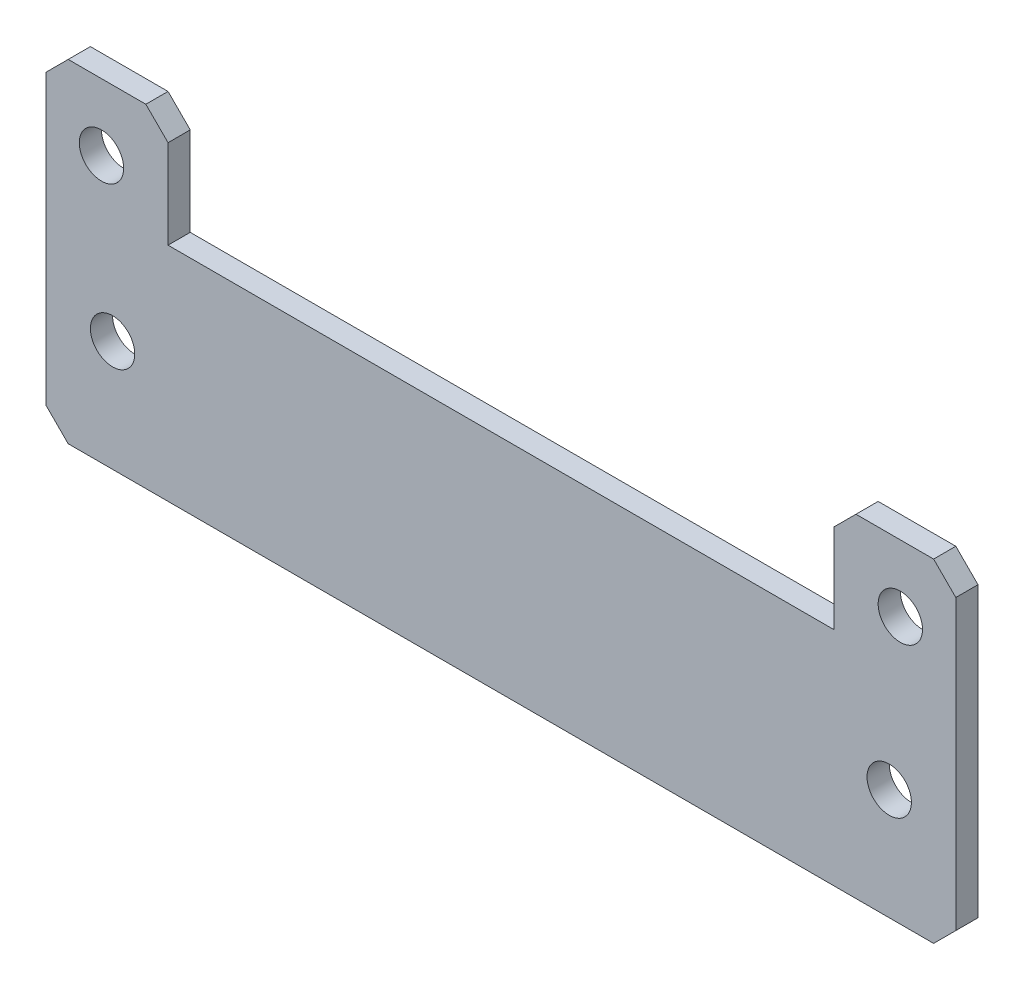
ISO-10303-21;
HEADER;
FILE_DESCRIPTION(('STEP AP214'),'2;1');
FILE_NAME('part.step','',(''),(''),'','','');
FILE_SCHEMA(('AUTOMOTIVE_DESIGN { 1 0 10303 214 1 1 1 1 }'));
ENDSEC;
DATA;
#1=APPLICATION_CONTEXT('core data for automotive mechanical design processes');
#2=APPLICATION_PROTOCOL_DEFINITION('international standard','automotive_design',2000,#1);
#3=PRODUCT_CONTEXT('',#1,'mechanical');
#4=PRODUCT('Part','Part','',(#3));
#5=PRODUCT_RELATED_PRODUCT_CATEGORY('part','',(#4));
#6=PRODUCT_DEFINITION_FORMATION('','',#4);
#7=PRODUCT_DEFINITION_CONTEXT('part definition',#1,'design');
#8=PRODUCT_DEFINITION('design','',#6,#7);
#9=PRODUCT_DEFINITION_SHAPE('','',#8);
#10=(LENGTH_UNIT() NAMED_UNIT(*) SI_UNIT(.MILLI.,.METRE.));
#11=(NAMED_UNIT(*) PLANE_ANGLE_UNIT() SI_UNIT($,.RADIAN.));
#12=(NAMED_UNIT(*) SI_UNIT($,.STERADIAN.) SOLID_ANGLE_UNIT());
#13=UNCERTAINTY_MEASURE_WITH_UNIT(LENGTH_MEASURE(1.E-05),#10,'distance_accuracy_value','');
#14=(GEOMETRIC_REPRESENTATION_CONTEXT(3) GLOBAL_UNCERTAINTY_ASSIGNED_CONTEXT((#13)) GLOBAL_UNIT_ASSIGNED_CONTEXT((#10,
#11,#12)) REPRESENTATION_CONTEXT('',''));
#15=CARTESIAN_POINT('',(0.,0.,0.));
#16=DIRECTION('',(0.,0.,1.));
#17=DIRECTION('',(1.,0.,0.));
#18=AXIS2_PLACEMENT_3D('',#15,#16,#17);
#19=CARTESIAN_POINT('',(-1.00000000000003,-1.00000000000003,2.));
#20=DIRECTION('',(0.707106781186548,0.707106781186547,0.));
#21=DIRECTION('',(-0.707106781186547,0.707106781186548,0.));
#22=AXIS2_PLACEMENT_3D('',#19,#20,#21);
#23=PLANE('',#22);
#24=DIRECTION('',(0.707106781186547,-0.707106781186548,0.));
#25=VECTOR('',#24,1.);
#26=CARTESIAN_POINT('',(-1.00000000000003,-1.00000000000003,0.));
#27=LINE('',#26,#25);
#28=CARTESIAN_POINT('',(-32.,30.,0.));
#29=VERTEX_POINT('',#28);
#30=CARTESIAN_POINT('',(-30.,28.,0.));
#31=VERTEX_POINT('',#30);
#32=EDGE_CURVE('E162',#29,#31,#27,.T.);
#33=ORIENTED_EDGE('',*,*,#32,.F.);
#34=DIRECTION('',(0.,0.,-1.));
#35=VECTOR('',#34,1.);
#36=CARTESIAN_POINT('',(-32.,30.,2.));
#37=LINE('',#36,#35);
#38=CARTESIAN_POINT('',(-32.,30.,2.));
#39=VERTEX_POINT('',#38);
#40=EDGE_CURVE('E11',#39,#29,#37,.T.);
#41=ORIENTED_EDGE('',*,*,#40,.F.);
#42=DIRECTION('',(0.707106781186547,-0.707106781186548,0.));
#43=VECTOR('',#42,1.);
#44=CARTESIAN_POINT('',(-1.00000000000003,-1.00000000000003,2.));
#45=LINE('',#44,#43);
#46=CARTESIAN_POINT('',(-30.,28.,2.));
#47=VERTEX_POINT('',#46);
#48=EDGE_CURVE('E195',#39,#47,#45,.T.);
#49=ORIENTED_EDGE('',*,*,#48,.T.);
#50=DIRECTION('',(0.,0.,-1.));
#51=VECTOR('',#50,1.);
#52=CARTESIAN_POINT('',(-30.,28.,2.));
#53=LINE('',#52,#51);
#54=EDGE_CURVE('E49',#47,#31,#53,.T.);
#55=ORIENTED_EDGE('',*,*,#54,.T.);
#56=EDGE_LOOP('',(#33,#41,#49,#55));
#57=FACE_BOUND('',#56,.T.);
#58=ADVANCED_FACE('F33',(#57),#23,.T.);
#59=CARTESIAN_POINT('',(0.,30.,2.));
#60=DIRECTION('',(0.,1.,0.));
#61=DIRECTION('',(0.,0.,1.));
#62=AXIS2_PLACEMENT_3D('',#59,#60,#61);
#63=PLANE('',#62);
#64=DIRECTION('',(1.,0.,0.));
#65=VECTOR('',#64,1.);
#66=CARTESIAN_POINT('',(0.,30.,0.));
#67=LINE('',#66,#65);
#68=CARTESIAN_POINT('',(-39.,30.,0.));
#69=VERTEX_POINT('',#68);
#70=EDGE_CURVE('E164',#69,#29,#67,.T.);
#71=ORIENTED_EDGE('',*,*,#70,.F.);
#72=DIRECTION('',(0.,0.,-1.));
#73=VECTOR('',#72,1.);
#74=CARTESIAN_POINT('',(-39.,30.,2.));
#75=LINE('',#74,#73);
#76=CARTESIAN_POINT('',(-39.,30.,2.));
#77=VERTEX_POINT('',#76);
#78=EDGE_CURVE('E41',#77,#69,#75,.T.);
#79=ORIENTED_EDGE('',*,*,#78,.F.);
#80=DIRECTION('',(1.,0.,0.));
#81=VECTOR('',#80,1.);
#82=CARTESIAN_POINT('',(0.,30.,2.));
#83=LINE('',#82,#81);
#84=EDGE_CURVE('E242',#77,#39,#83,.T.);
#85=ORIENTED_EDGE('',*,*,#84,.T.);
#86=ORIENTED_EDGE('',*,*,#40,.T.);
#87=EDGE_LOOP('',(#71,#79,#85,#86));
#88=FACE_BOUND('',#87,.T.);
#89=ADVANCED_FACE('F229',(#88),#63,.T.);
#90=CARTESIAN_POINT('',(-34.5,34.5,2.));
#91=DIRECTION('',(-0.707106781186547,0.707106781186547,0.));
#92=DIRECTION('',(-0.707106781186548,-0.707106781186548,0.));
#93=AXIS2_PLACEMENT_3D('',#90,#91,#92);
#94=PLANE('',#93);
#95=DIRECTION('',(0.707106781186548,0.707106781186548,0.));
#96=VECTOR('',#95,1.);
#97=CARTESIAN_POINT('',(-34.5,34.5,0.));
#98=LINE('',#97,#96);
#99=CARTESIAN_POINT('',(-41.,28.,0.));
#100=VERTEX_POINT('',#99);
#101=EDGE_CURVE('E168',#100,#69,#98,.T.);
#102=ORIENTED_EDGE('',*,*,#101,.F.);
#103=DIRECTION('',(0.,0.,-1.));
#104=VECTOR('',#103,1.);
#105=CARTESIAN_POINT('',(-41.,28.,2.));
#106=LINE('',#105,#104);
#107=CARTESIAN_POINT('',(-41.,28.,2.));
#108=VERTEX_POINT('',#107);
#109=EDGE_CURVE('E218',#108,#100,#106,.T.);
#110=ORIENTED_EDGE('',*,*,#109,.F.);
#111=DIRECTION('',(0.707106781186548,0.707106781186548,0.));
#112=VECTOR('',#111,1.);
#113=CARTESIAN_POINT('',(-34.5,34.5,2.));
#114=LINE('',#113,#112);
#115=EDGE_CURVE('E225',#108,#77,#114,.T.);
#116=ORIENTED_EDGE('',*,*,#115,.T.);
#117=ORIENTED_EDGE('',*,*,#78,.T.);
#118=EDGE_LOOP('',(#102,#110,#116,#117));
#119=FACE_BOUND('',#118,.T.);
#120=ADVANCED_FACE('F223',(#119),#94,.T.);
#121=CARTESIAN_POINT('',(-41.,0.,2.));
#122=DIRECTION('',(-1.,0.,0.));
#123=DIRECTION('',(0.,0.,1.));
#124=AXIS2_PLACEMENT_3D('',#121,#122,#123);
#125=PLANE('',#124);
#126=DIRECTION('',(0.,1.,0.));
#127=VECTOR('',#126,1.);
#128=CARTESIAN_POINT('',(-41.,0.,0.));
#129=LINE('',#128,#127);
#130=CARTESIAN_POINT('',(-41.,2.,0.));
#131=VERTEX_POINT('',#130);
#132=EDGE_CURVE('E171',#131,#100,#129,.T.);
#133=ORIENTED_EDGE('',*,*,#132,.F.);
#134=DIRECTION('',(0.,0.,-1.));
#135=VECTOR('',#134,1.);
#136=CARTESIAN_POINT('',(-41.,2.,2.));
#137=LINE('',#136,#135);
#138=CARTESIAN_POINT('',(-41.,2.,2.));
#139=VERTEX_POINT('',#138);
#140=EDGE_CURVE('E216',#139,#131,#137,.T.);
#141=ORIENTED_EDGE('',*,*,#140,.F.);
#142=DIRECTION('',(0.,1.,0.));
#143=VECTOR('',#142,1.);
#144=CARTESIAN_POINT('',(-41.,0.,2.));
#145=LINE('',#144,#143);
#146=EDGE_CURVE('E239',#139,#108,#145,.T.);
#147=ORIENTED_EDGE('',*,*,#146,.T.);
#148=ORIENTED_EDGE('',*,*,#109,.T.);
#149=EDGE_LOOP('',(#133,#141,#147,#148));
#150=FACE_BOUND('',#149,.T.);
#151=ADVANCED_FACE('F236',(#150),#125,.T.);
#152=CARTESIAN_POINT('',(-19.5,-19.5,2.));
#153=DIRECTION('',(-0.707106781186547,-0.707106781186548,0.));
#154=DIRECTION('',(0.707106781186548,-0.707106781186547,0.));
#155=AXIS2_PLACEMENT_3D('',#152,#153,#154);
#156=PLANE('',#155);
#157=DIRECTION('',(-0.707106781186548,0.707106781186547,0.));
#158=VECTOR('',#157,1.);
#159=CARTESIAN_POINT('',(-19.5,-19.5,0.));
#160=LINE('',#159,#158);
#161=CARTESIAN_POINT('',(-39.,0.,0.));
#162=VERTEX_POINT('',#161);
#163=EDGE_CURVE('E174',#162,#131,#160,.T.);
#164=ORIENTED_EDGE('',*,*,#163,.F.);
#165=DIRECTION('',(0.,0.,-1.));
#166=VECTOR('',#165,1.);
#167=CARTESIAN_POINT('',(-39.,0.,2.));
#168=LINE('',#167,#166);
#169=CARTESIAN_POINT('',(-39.,0.,2.));
#170=VERTEX_POINT('',#169);
#171=EDGE_CURVE('E214',#170,#162,#168,.T.);
#172=ORIENTED_EDGE('',*,*,#171,.F.);
#173=DIRECTION('',(-0.707106781186548,0.707106781186547,0.));
#174=VECTOR('',#173,1.);
#175=CARTESIAN_POINT('',(-19.5,-19.5,2.));
#176=LINE('',#175,#174);
#177=EDGE_CURVE('E244',#170,#139,#176,.T.);
#178=ORIENTED_EDGE('',*,*,#177,.T.);
#179=ORIENTED_EDGE('',*,*,#140,.T.);
#180=EDGE_LOOP('',(#164,#172,#178,#179));
#181=FACE_BOUND('',#180,.T.);
#182=ADVANCED_FACE('F291',(#181),#156,.T.);
#183=CARTESIAN_POINT('',(0.,0.,2.));
#184=DIRECTION('',(0.,1.,0.));
#185=DIRECTION('',(0.,0.,1.));
#186=AXIS2_PLACEMENT_3D('',#183,#184,#185);
#187=PLANE('',#186);
#188=DIRECTION('',(1.,0.,0.));
#189=VECTOR('',#188,1.);
#190=CARTESIAN_POINT('',(0.,0.,0.));
#191=LINE('',#190,#189);
#192=CARTESIAN_POINT('',(39.,0.,0.));
#193=VERTEX_POINT('',#192);
#194=EDGE_CURVE('E177',#162,#193,#191,.T.);
#195=ORIENTED_EDGE('',*,*,#194,.T.);
#196=DIRECTION('',(0.,0.,-1.));
#197=VECTOR('',#196,1.);
#198=CARTESIAN_POINT('',(39.,0.,2.));
#199=LINE('',#198,#197);
#200=CARTESIAN_POINT('',(39.,0.,2.));
#201=VERTEX_POINT('',#200);
#202=EDGE_CURVE('E211',#201,#193,#199,.T.);
#203=ORIENTED_EDGE('',*,*,#202,.F.);
#204=DIRECTION('',(1.,0.,0.));
#205=VECTOR('',#204,1.);
#206=CARTESIAN_POINT('',(0.,0.,2.));
#207=LINE('',#206,#205);
#208=EDGE_CURVE('E250',#170,#201,#207,.T.);
#209=ORIENTED_EDGE('',*,*,#208,.F.);
#210=ORIENTED_EDGE('',*,*,#171,.T.);
#211=EDGE_LOOP('',(#195,#203,#209,#210));
#212=FACE_BOUND('',#211,.T.);
#213=ADVANCED_FACE('F294',(#212),#187,.F.);
#214=CARTESIAN_POINT('',(19.5,-19.5,2.));
#215=DIRECTION('',(-0.707106781186547,0.707106781186548,0.));
#216=DIRECTION('',(-0.707106781186548,-0.707106781186547,0.));
#217=AXIS2_PLACEMENT_3D('',#214,#215,#216);
#218=PLANE('',#217);
#219=DIRECTION('',(0.707106781186548,0.707106781186547,0.));
#220=VECTOR('',#219,1.);
#221=CARTESIAN_POINT('',(19.5,-19.5,0.));
#222=LINE('',#221,#220);
#223=CARTESIAN_POINT('',(41.,2.,0.));
#224=VERTEX_POINT('',#223);
#225=EDGE_CURVE('E179',#193,#224,#222,.T.);
#226=ORIENTED_EDGE('',*,*,#225,.T.);
#227=DIRECTION('',(0.,0.,-1.));
#228=VECTOR('',#227,1.);
#229=CARTESIAN_POINT('',(41.,2.,2.));
#230=LINE('',#229,#228);
#231=CARTESIAN_POINT('',(41.,2.,2.));
#232=VERTEX_POINT('',#231);
#233=EDGE_CURVE('E208',#232,#224,#230,.T.);
#234=ORIENTED_EDGE('',*,*,#233,.F.);
#235=DIRECTION('',(0.707106781186548,0.707106781186547,0.));
#236=VECTOR('',#235,1.);
#237=CARTESIAN_POINT('',(19.5,-19.5,2.));
#238=LINE('',#237,#236);
#239=EDGE_CURVE('E252',#201,#232,#238,.T.);
#240=ORIENTED_EDGE('',*,*,#239,.F.);
#241=ORIENTED_EDGE('',*,*,#202,.T.);
#242=EDGE_LOOP('',(#226,#234,#240,#241));
#243=FACE_BOUND('',#242,.T.);
#244=ADVANCED_FACE('F298',(#243),#218,.F.);
#245=CARTESIAN_POINT('',(41.,0.,2.));
#246=DIRECTION('',(-1.,0.,0.));
#247=DIRECTION('',(0.,0.,1.));
#248=AXIS2_PLACEMENT_3D('',#245,#246,#247);
#249=PLANE('',#248);
#250=DIRECTION('',(0.,1.,0.));
#251=VECTOR('',#250,1.);
#252=CARTESIAN_POINT('',(41.,0.,0.));
#253=LINE('',#252,#251);
#254=CARTESIAN_POINT('',(41.,28.,0.));
#255=VERTEX_POINT('',#254);
#256=EDGE_CURVE('E181',#224,#255,#253,.T.);
#257=ORIENTED_EDGE('',*,*,#256,.T.);
#258=DIRECTION('',(0.,0.,-1.));
#259=VECTOR('',#258,1.);
#260=CARTESIAN_POINT('',(41.,28.,2.));
#261=LINE('',#260,#259);
#262=CARTESIAN_POINT('',(41.,28.,2.));
#263=VERTEX_POINT('',#262);
#264=EDGE_CURVE('E205',#263,#255,#261,.T.);
#265=ORIENTED_EDGE('',*,*,#264,.F.);
#266=DIRECTION('',(0.,1.,0.));
#267=VECTOR('',#266,1.);
#268=CARTESIAN_POINT('',(41.,0.,2.));
#269=LINE('',#268,#267);
#270=EDGE_CURVE('E254',#232,#263,#269,.T.);
#271=ORIENTED_EDGE('',*,*,#270,.F.);
#272=ORIENTED_EDGE('',*,*,#233,.T.);
#273=EDGE_LOOP('',(#257,#265,#271,#272));
#274=FACE_BOUND('',#273,.T.);
#275=ADVANCED_FACE('F302',(#274),#249,.F.);
#276=CARTESIAN_POINT('',(34.5,34.5,2.));
#277=DIRECTION('',(-0.707106781186547,-0.707106781186548,0.));
#278=DIRECTION('',(0.707106781186548,-0.707106781186547,0.));
#279=AXIS2_PLACEMENT_3D('',#276,#277,#278);
#280=PLANE('',#279);
#281=DIRECTION('',(-0.707106781186548,0.707106781186547,0.));
#282=VECTOR('',#281,1.);
#283=CARTESIAN_POINT('',(34.5,34.5,0.));
#284=LINE('',#283,#282);
#285=CARTESIAN_POINT('',(39.,30.,0.));
#286=VERTEX_POINT('',#285);
#287=EDGE_CURVE('E183',#255,#286,#284,.T.);
#288=ORIENTED_EDGE('',*,*,#287,.T.);
#289=DIRECTION('',(0.,0.,-1.));
#290=VECTOR('',#289,1.);
#291=CARTESIAN_POINT('',(39.,30.,2.));
#292=LINE('',#291,#290);
#293=CARTESIAN_POINT('',(39.,30.,2.));
#294=VERTEX_POINT('',#293);
#295=EDGE_CURVE('E202',#294,#286,#292,.T.);
#296=ORIENTED_EDGE('',*,*,#295,.F.);
#297=DIRECTION('',(-0.707106781186548,0.707106781186547,0.));
#298=VECTOR('',#297,1.);
#299=CARTESIAN_POINT('',(34.5,34.5,2.));
#300=LINE('',#299,#298);
#301=EDGE_CURVE('E256',#263,#294,#300,.T.);
#302=ORIENTED_EDGE('',*,*,#301,.F.);
#303=ORIENTED_EDGE('',*,*,#264,.T.);
#304=EDGE_LOOP('',(#288,#296,#302,#303));
#305=FACE_BOUND('',#304,.T.);
#306=ADVANCED_FACE('F306',(#305),#280,.F.);
#307=CARTESIAN_POINT('',(0.,30.,2.));
#308=DIRECTION('',(0.,-1.,0.));
#309=DIRECTION('',(0.,0.,-1.));
#310=AXIS2_PLACEMENT_3D('',#307,#308,#309);
#311=PLANE('',#310);
#312=DIRECTION('',(-1.,0.,0.));
#313=VECTOR('',#312,1.);
#314=CARTESIAN_POINT('',(0.,30.,0.));
#315=LINE('',#314,#313);
#316=CARTESIAN_POINT('',(32.,30.,0.));
#317=VERTEX_POINT('',#316);
#318=EDGE_CURVE('E185',#286,#317,#315,.T.);
#319=ORIENTED_EDGE('',*,*,#318,.T.);
#320=DIRECTION('',(0.,0.,-1.));
#321=VECTOR('',#320,1.);
#322=CARTESIAN_POINT('',(32.,30.,2.));
#323=LINE('',#322,#321);
#324=CARTESIAN_POINT('',(32.,30.,2.));
#325=VERTEX_POINT('',#324);
#326=EDGE_CURVE('E199',#325,#317,#323,.T.);
#327=ORIENTED_EDGE('',*,*,#326,.F.);
#328=DIRECTION('',(-1.,0.,0.));
#329=VECTOR('',#328,1.);
#330=CARTESIAN_POINT('',(0.,30.,2.));
#331=LINE('',#330,#329);
#332=EDGE_CURVE('E258',#294,#325,#331,.T.);
#333=ORIENTED_EDGE('',*,*,#332,.F.);
#334=ORIENTED_EDGE('',*,*,#295,.T.);
#335=EDGE_LOOP('',(#319,#327,#333,#334));
#336=FACE_BOUND('',#335,.T.);
#337=ADVANCED_FACE('F264',(#336),#311,.F.);
#338=CARTESIAN_POINT('',(1.00000000000003,-1.00000000000003,2.));
#339=DIRECTION('',(0.707106781186548,-0.707106781186547,0.));
#340=DIRECTION('',(0.707106781186547,0.707106781186548,0.));
#341=AXIS2_PLACEMENT_3D('',#338,#339,#340);
#342=PLANE('',#341);
#343=DIRECTION('',(-0.707106781186547,-0.707106781186548,0.));
#344=VECTOR('',#343,1.);
#345=CARTESIAN_POINT('',(1.00000000000003,-1.00000000000003,0.));
#346=LINE('',#345,#344);
#347=CARTESIAN_POINT('',(30.,28.,0.));
#348=VERTEX_POINT('',#347);
#349=EDGE_CURVE('E187',#317,#348,#346,.T.);
#350=ORIENTED_EDGE('',*,*,#349,.T.);
#351=DIRECTION('',(0.,0.,-1.));
#352=VECTOR('',#351,1.);
#353=CARTESIAN_POINT('',(30.,28.,2.));
#354=LINE('',#353,#352);
#355=CARTESIAN_POINT('',(30.,28.,2.));
#356=VERTEX_POINT('',#355);
#357=EDGE_CURVE('E154',#356,#348,#354,.T.);
#358=ORIENTED_EDGE('',*,*,#357,.F.);
#359=DIRECTION('',(-0.707106781186547,-0.707106781186548,0.));
#360=VECTOR('',#359,1.);
#361=CARTESIAN_POINT('',(1.00000000000003,-1.00000000000003,2.));
#362=LINE('',#361,#360);
#363=EDGE_CURVE('E142',#325,#356,#362,.T.);
#364=ORIENTED_EDGE('',*,*,#363,.F.);
#365=ORIENTED_EDGE('',*,*,#326,.T.);
#366=EDGE_LOOP('',(#350,#358,#364,#365));
#367=FACE_BOUND('',#366,.T.);
#368=ADVANCED_FACE('F268',(#367),#342,.F.);
#369=CARTESIAN_POINT('',(30.,0.,2.));
#370=DIRECTION('',(1.,0.,0.));
#371=DIRECTION('',(0.,0.,-1.));
#372=AXIS2_PLACEMENT_3D('',#369,#370,#371);
#373=PLANE('',#372);
#374=DIRECTION('',(0.,-1.,0.));
#375=VECTOR('',#374,1.);
#376=CARTESIAN_POINT('',(30.,0.,0.));
#377=LINE('',#376,#375);
#378=CARTESIAN_POINT('',(30.,20.,0.));
#379=VERTEX_POINT('',#378);
#380=EDGE_CURVE('E151',#348,#379,#377,.T.);
#381=ORIENTED_EDGE('',*,*,#380,.T.);
#382=DIRECTION('',(0.,0.,-1.));
#383=VECTOR('',#382,1.);
#384=CARTESIAN_POINT('',(30.,20.,2.));
#385=LINE('',#384,#383);
#386=CARTESIAN_POINT('',(30.,20.,2.));
#387=VERTEX_POINT('',#386);
#388=EDGE_CURVE('E148',#387,#379,#385,.T.);
#389=ORIENTED_EDGE('',*,*,#388,.F.);
#390=DIRECTION('',(0.,-1.,0.));
#391=VECTOR('',#390,1.);
#392=CARTESIAN_POINT('',(30.,0.,2.));
#393=LINE('',#392,#391);
#394=EDGE_CURVE('E135',#356,#387,#393,.T.);
#395=ORIENTED_EDGE('',*,*,#394,.F.);
#396=ORIENTED_EDGE('',*,*,#357,.T.);
#397=EDGE_LOOP('',(#381,#389,#395,#396));
#398=FACE_BOUND('',#397,.T.);
#399=ADVANCED_FACE('F149',(#398),#373,.F.);
#400=CARTESIAN_POINT('',(0.,20.,2.));
#401=DIRECTION('',(0.,-1.,0.));
#402=DIRECTION('',(0.,0.,-1.));
#403=AXIS2_PLACEMENT_3D('',#400,#401,#402);
#404=PLANE('',#403);
#405=DIRECTION('',(-1.,0.,0.));
#406=VECTOR('',#405,1.);
#407=CARTESIAN_POINT('',(0.,20.,0.));
#408=LINE('',#407,#406);
#409=CARTESIAN_POINT('',(-30.,20.,0.));
#410=VERTEX_POINT('',#409);
#411=EDGE_CURVE('E190',#379,#410,#408,.T.);
#412=ORIENTED_EDGE('',*,*,#411,.T.);
#413=DIRECTION('',(0.,0.,-1.));
#414=VECTOR('',#413,1.);
#415=CARTESIAN_POINT('',(-30.,20.,2.));
#416=LINE('',#415,#414);
#417=CARTESIAN_POINT('',(-30.,20.,2.));
#418=VERTEX_POINT('',#417);
#419=EDGE_CURVE('E93',#418,#410,#416,.T.);
#420=ORIENTED_EDGE('',*,*,#419,.F.);
#421=DIRECTION('',(-1.,0.,0.));
#422=VECTOR('',#421,1.);
#423=CARTESIAN_POINT('',(0.,20.,2.));
#424=LINE('',#423,#422);
#425=EDGE_CURVE('E140',#387,#418,#424,.T.);
#426=ORIENTED_EDGE('',*,*,#425,.F.);
#427=ORIENTED_EDGE('',*,*,#388,.T.);
#428=EDGE_LOOP('',(#412,#420,#426,#427));
#429=FACE_BOUND('',#428,.T.);
#430=ADVANCED_FACE('F156',(#429),#404,.F.);
#431=CARTESIAN_POINT('',(-30.,0.,2.));
#432=DIRECTION('',(1.,0.,0.));
#433=DIRECTION('',(0.,0.,-1.));
#434=AXIS2_PLACEMENT_3D('',#431,#432,#433);
#435=PLANE('',#434);
#436=DIRECTION('',(0.,-1.,0.));
#437=VECTOR('',#436,1.);
#438=CARTESIAN_POINT('',(-30.,0.,0.));
#439=LINE('',#438,#437);
#440=EDGE_CURVE('E192',#31,#410,#439,.T.);
#441=ORIENTED_EDGE('',*,*,#440,.F.);
#442=ORIENTED_EDGE('',*,*,#54,.F.);
#443=DIRECTION('',(0.,-1.,0.));
#444=VECTOR('',#443,1.);
#445=CARTESIAN_POINT('',(-30.,0.,2.));
#446=LINE('',#445,#444);
#447=EDGE_CURVE('E157',#47,#418,#446,.T.);
#448=ORIENTED_EDGE('',*,*,#447,.T.);
#449=ORIENTED_EDGE('',*,*,#419,.T.);
#450=EDGE_LOOP('',(#441,#442,#448,#449));
#451=FACE_BOUND('',#450,.T.);
#452=ADVANCED_FACE('F269',(#451),#435,.T.);
#453=CARTESIAN_POINT('',(0.,0.,2.));
#454=DIRECTION('',(0.,0.,1.));
#455=DIRECTION('',(1.,0.,0.));
#456=AXIS2_PLACEMENT_3D('',#453,#454,#455);
#457=PLANE('',#456);
#458=CARTESIAN_POINT('',(35.,10.,2.));
#459=DIRECTION('',(0.,0.,-1.));
#460=DIRECTION('',(-1.,0.,0.));
#461=AXIS2_PLACEMENT_3D('',#458,#459,#460);
#462=CIRCLE('',#461,2.);
#463=CARTESIAN_POINT('',(33.,10.,2.));
#464=VERTEX_POINT('',#463);
#465=EDGE_CURVE('E391',#464,#464,#462,.T.);
#466=ORIENTED_EDGE('',*,*,#465,.T.);
#467=EDGE_LOOP('',(#466));
#468=FACE_BOUND('',#467,.T.);
#469=CARTESIAN_POINT('',(-35.,10.,2.));
#470=DIRECTION('',(0.,0.,-1.));
#471=DIRECTION('',(-1.,0.,0.));
#472=AXIS2_PLACEMENT_3D('',#469,#470,#471);
#473=CIRCLE('',#472,2.);
#474=CARTESIAN_POINT('',(-37.,10.,2.));
#475=VERTEX_POINT('',#474);
#476=EDGE_CURVE('E395',#475,#475,#473,.T.);
#477=ORIENTED_EDGE('',*,*,#476,.T.);
#478=EDGE_LOOP('',(#477));
#479=FACE_BOUND('',#478,.T.);
#480=CARTESIAN_POINT('',(-36.,24.,2.));
#481=DIRECTION('',(0.,0.,1.));
#482=DIRECTION('',(1.,0.,0.));
#483=AXIS2_PLACEMENT_3D('',#480,#481,#482);
#484=CIRCLE('',#483,2.);
#485=CARTESIAN_POINT('',(-34.,24.,2.));
#486=VERTEX_POINT('',#485);
#487=EDGE_CURVE('E407',#486,#486,#484,.T.);
#488=ORIENTED_EDGE('',*,*,#487,.F.);
#489=EDGE_LOOP('',(#488));
#490=FACE_BOUND('',#489,.T.);
#491=CARTESIAN_POINT('',(36.,24.,2.));
#492=DIRECTION('',(0.,0.,1.));
#493=DIRECTION('',(1.,0.,0.));
#494=AXIS2_PLACEMENT_3D('',#491,#492,#493);
#495=CIRCLE('',#494,2.);
#496=CARTESIAN_POINT('',(38.,24.,2.));
#497=VERTEX_POINT('',#496);
#498=EDGE_CURVE('E397',#497,#497,#495,.T.);
#499=ORIENTED_EDGE('',*,*,#498,.F.);
#500=EDGE_LOOP('',(#499));
#501=FACE_BOUND('',#500,.T.);
#502=ORIENTED_EDGE('',*,*,#48,.F.);
#503=ORIENTED_EDGE('',*,*,#84,.F.);
#504=ORIENTED_EDGE('',*,*,#115,.F.);
#505=ORIENTED_EDGE('',*,*,#146,.F.);
#506=ORIENTED_EDGE('',*,*,#177,.F.);
#507=ORIENTED_EDGE('',*,*,#208,.T.);
#508=ORIENTED_EDGE('',*,*,#239,.T.);
#509=ORIENTED_EDGE('',*,*,#270,.T.);
#510=ORIENTED_EDGE('',*,*,#301,.T.);
#511=ORIENTED_EDGE('',*,*,#332,.T.);
#512=ORIENTED_EDGE('',*,*,#363,.T.);
#513=ORIENTED_EDGE('',*,*,#394,.T.);
#514=ORIENTED_EDGE('',*,*,#425,.T.);
#515=ORIENTED_EDGE('',*,*,#447,.F.);
#516=EDGE_LOOP('',(#502,#503,#504,#505,#506,#507,#508,#509,#510,#511,#512,#513,#514,#515));
#517=FACE_BOUND('',#516,.T.);
#518=ADVANCED_FACE('F137',(#468,#479,#490,#501,#517),#457,.T.);
#519=CARTESIAN_POINT('',(0.,0.,0.));
#520=DIRECTION('',(0.,0.,1.));
#521=DIRECTION('',(1.,0.,0.));
#522=AXIS2_PLACEMENT_3D('',#519,#520,#521);
#523=PLANE('',#522);
#524=CARTESIAN_POINT('',(35.,10.,0.));
#525=DIRECTION('',(0.,0.,-1.));
#526=DIRECTION('',(-1.,0.,0.));
#527=AXIS2_PLACEMENT_3D('',#524,#525,#526);
#528=CIRCLE('',#527,2.);
#529=CARTESIAN_POINT('',(33.,10.,0.));
#530=VERTEX_POINT('',#529);
#531=EDGE_CURVE('E394',#530,#530,#528,.T.);
#532=ORIENTED_EDGE('',*,*,#531,.F.);
#533=EDGE_LOOP('',(#532));
#534=FACE_BOUND('',#533,.T.);
#535=CARTESIAN_POINT('',(-35.,10.,0.));
#536=DIRECTION('',(0.,0.,-1.));
#537=DIRECTION('',(-1.,0.,0.));
#538=AXIS2_PLACEMENT_3D('',#535,#536,#537);
#539=CIRCLE('',#538,2.);
#540=CARTESIAN_POINT('',(-37.,10.,0.));
#541=VERTEX_POINT('',#540);
#542=EDGE_CURVE('E400',#541,#541,#539,.T.);
#543=ORIENTED_EDGE('',*,*,#542,.F.);
#544=EDGE_LOOP('',(#543));
#545=FACE_BOUND('',#544,.T.);
#546=CARTESIAN_POINT('',(-36.,24.,0.));
#547=DIRECTION('',(0.,0.,1.));
#548=DIRECTION('',(1.,0.,0.));
#549=AXIS2_PLACEMENT_3D('',#546,#547,#548);
#550=CIRCLE('',#549,2.);
#551=CARTESIAN_POINT('',(-34.,24.,0.));
#552=VERTEX_POINT('',#551);
#553=EDGE_CURVE('E165',#552,#552,#550,.T.);
#554=ORIENTED_EDGE('',*,*,#553,.T.);
#555=EDGE_LOOP('',(#554));
#556=FACE_BOUND('',#555,.T.);
#557=CARTESIAN_POINT('',(36.,24.,0.));
#558=DIRECTION('',(0.,0.,1.));
#559=DIRECTION('',(1.,0.,0.));
#560=AXIS2_PLACEMENT_3D('',#557,#558,#559);
#561=CIRCLE('',#560,2.);
#562=CARTESIAN_POINT('',(38.,24.,0.));
#563=VERTEX_POINT('',#562);
#564=EDGE_CURVE('E410',#563,#563,#561,.T.);
#565=ORIENTED_EDGE('',*,*,#564,.T.);
#566=EDGE_LOOP('',(#565));
#567=FACE_BOUND('',#566,.T.);
#568=ORIENTED_EDGE('',*,*,#32,.T.);
#569=ORIENTED_EDGE('',*,*,#440,.T.);
#570=ORIENTED_EDGE('',*,*,#411,.F.);
#571=ORIENTED_EDGE('',*,*,#380,.F.);
#572=ORIENTED_EDGE('',*,*,#349,.F.);
#573=ORIENTED_EDGE('',*,*,#318,.F.);
#574=ORIENTED_EDGE('',*,*,#287,.F.);
#575=ORIENTED_EDGE('',*,*,#256,.F.);
#576=ORIENTED_EDGE('',*,*,#225,.F.);
#577=ORIENTED_EDGE('',*,*,#194,.F.);
#578=ORIENTED_EDGE('',*,*,#163,.T.);
#579=ORIENTED_EDGE('',*,*,#132,.T.);
#580=ORIENTED_EDGE('',*,*,#101,.T.);
#581=ORIENTED_EDGE('',*,*,#70,.T.);
#582=EDGE_LOOP('',(#568,#569,#570,#571,#572,#573,#574,#575,#576,#577,#578,#579,#580,#581));
#583=FACE_BOUND('',#582,.T.);
#584=ADVANCED_FACE('F231',(#534,#545,#556,#567,#583),#523,.F.);
#585=CARTESIAN_POINT('',(36.,24.,0.));
#586=DIRECTION('',(0.,0.,1.));
#587=DIRECTION('',(1.,0.,0.));
#588=AXIS2_PLACEMENT_3D('',#585,#586,#587);
#589=CYLINDRICAL_SURFACE('',#588,2.);
#590=ORIENTED_EDGE('',*,*,#564,.F.);
#591=EDGE_LOOP('',(#590));
#592=FACE_BOUND('',#591,.T.);
#593=ORIENTED_EDGE('',*,*,#498,.T.);
#594=EDGE_LOOP('',(#593));
#595=FACE_BOUND('',#594,.T.);
#596=ADVANCED_FACE('F334',(#592,#595),#589,.F.);
#597=CARTESIAN_POINT('',(-36.,24.,0.));
#598=DIRECTION('',(0.,0.,1.));
#599=DIRECTION('',(1.,0.,0.));
#600=AXIS2_PLACEMENT_3D('',#597,#598,#599);
#601=CYLINDRICAL_SURFACE('',#600,2.);
#602=ORIENTED_EDGE('',*,*,#553,.F.);
#603=EDGE_LOOP('',(#602));
#604=FACE_BOUND('',#603,.T.);
#605=ORIENTED_EDGE('',*,*,#487,.T.);
#606=EDGE_LOOP('',(#605));
#607=FACE_BOUND('',#606,.T.);
#608=ADVANCED_FACE('F339',(#604,#607),#601,.F.);
#609=CARTESIAN_POINT('',(-35.,10.,2.));
#610=DIRECTION('',(0.,0.,-1.));
#611=DIRECTION('',(-1.,0.,0.));
#612=AXIS2_PLACEMENT_3D('',#609,#610,#611);
#613=CYLINDRICAL_SURFACE('',#612,2.);
#614=ORIENTED_EDGE('',*,*,#476,.F.);
#615=EDGE_LOOP('',(#614));
#616=FACE_BOUND('',#615,.T.);
#617=ORIENTED_EDGE('',*,*,#542,.T.);
#618=EDGE_LOOP('',(#617));
#619=FACE_BOUND('',#618,.T.);
#620=ADVANCED_FACE('F351',(#616,#619),#613,.F.);
#621=CARTESIAN_POINT('',(35.,10.,2.));
#622=DIRECTION('',(0.,0.,-1.));
#623=DIRECTION('',(-1.,0.,0.));
#624=AXIS2_PLACEMENT_3D('',#621,#622,#623);
#625=CYLINDRICAL_SURFACE('',#624,2.);
#626=ORIENTED_EDGE('',*,*,#465,.F.);
#627=EDGE_LOOP('',(#626));
#628=FACE_BOUND('',#627,.T.);
#629=ORIENTED_EDGE('',*,*,#531,.T.);
#630=EDGE_LOOP('',(#629));
#631=FACE_BOUND('',#630,.T.);
#632=ADVANCED_FACE('F374',(#628,#631),#625,.F.);
#633=CLOSED_SHELL('',(#58,#89,#120,#151,#182,#213,#244,#275,#306,#337,#368,#399,#430,#452,#518,
#584,#596,#608,#620,#632));
#634=MANIFOLD_SOLID_BREP('B2',#633);
#635=ADVANCED_BREP_SHAPE_REPRESENTATION('',(#18,#634),#14);
#636=SHAPE_DEFINITION_REPRESENTATION(#9,#635);
ENDSEC;
END-ISO-10303-21;
